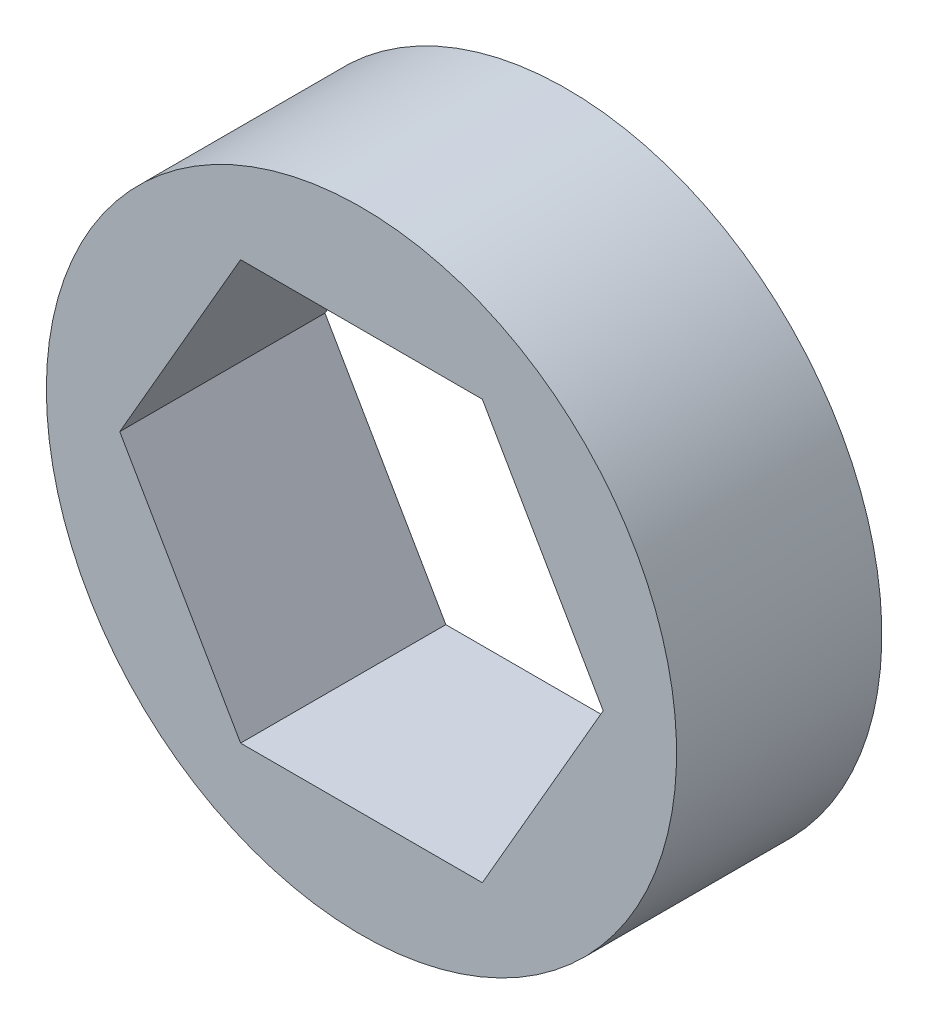
ISO-10303-21;
HEADER;
FILE_DESCRIPTION(('STEP AP214'),'2;1');
FILE_NAME('part.step','',(''),(''),'','','');
FILE_SCHEMA(('AUTOMOTIVE_DESIGN { 1 0 10303 214 1 1 1 1 }'));
ENDSEC;
DATA;
#1=APPLICATION_CONTEXT('core data for automotive mechanical design processes');
#2=APPLICATION_PROTOCOL_DEFINITION('international standard','automotive_design',2000,#1);
#3=PRODUCT_CONTEXT('',#1,'mechanical');
#4=PRODUCT('Part','Part','',(#3));
#5=PRODUCT_RELATED_PRODUCT_CATEGORY('part','',(#4));
#6=PRODUCT_DEFINITION_FORMATION('','',#4);
#7=PRODUCT_DEFINITION_CONTEXT('part definition',#1,'design');
#8=PRODUCT_DEFINITION('design','',#6,#7);
#9=PRODUCT_DEFINITION_SHAPE('','',#8);
#10=(LENGTH_UNIT() NAMED_UNIT(*) SI_UNIT(.MILLI.,.METRE.));
#11=(NAMED_UNIT(*) PLANE_ANGLE_UNIT() SI_UNIT($,.RADIAN.));
#12=(NAMED_UNIT(*) SI_UNIT($,.STERADIAN.) SOLID_ANGLE_UNIT());
#13=UNCERTAINTY_MEASURE_WITH_UNIT(LENGTH_MEASURE(1.E-05),#10,'distance_accuracy_value','');
#14=(GEOMETRIC_REPRESENTATION_CONTEXT(3) GLOBAL_UNCERTAINTY_ASSIGNED_CONTEXT((#13)) GLOBAL_UNIT_ASSIGNED_CONTEXT((#10,
#11,#12)) REPRESENTATION_CONTEXT('',''));
#15=CARTESIAN_POINT('',(0.,0.,0.));
#16=DIRECTION('',(0.,0.,1.));
#17=DIRECTION('',(1.,0.,0.));
#18=AXIS2_PLACEMENT_3D('',#15,#16,#17);
#19=CARTESIAN_POINT('',(-7.47899538708241,0.,3.175));
#20=DIRECTION('',(0.866025403784439,0.5,0.));
#21=DIRECTION('',(-0.5,0.866025403784439,0.));
#22=AXIS2_PLACEMENT_3D('',#19,#20,#21);
#23=PLANE('',#22);
#24=DIRECTION('',(-0.5,0.866025403784438,0.));
#25=VECTOR('',#24,1.);
#26=CARTESIAN_POINT('',(-3.73949769354121,-6.477,3.175));
#27=LINE('',#26,#25);
#28=CARTESIAN_POINT('',(-3.73949769354121,-6.477,3.175));
#29=VERTEX_POINT('',#28);
#30=CARTESIAN_POINT('',(-7.47899538708241,0.,3.175));
#31=VERTEX_POINT('',#30);
#32=EDGE_CURVE('E84',#29,#31,#27,.T.);
#33=ORIENTED_EDGE('',*,*,#32,.F.);
#34=DIRECTION('',(0.,0.,1.));
#35=VECTOR('',#34,1.);
#36=CARTESIAN_POINT('',(-3.73949769354121,-6.477,3.175));
#37=LINE('',#36,#35);
#38=CARTESIAN_POINT('',(-3.73949769354121,-6.477,-3.175));
#39=VERTEX_POINT('',#38);
#40=EDGE_CURVE('E76',#39,#29,#37,.T.);
#41=ORIENTED_EDGE('',*,*,#40,.F.);
#42=DIRECTION('',(-0.5,0.866025403784439,0.));
#43=VECTOR('',#42,1.);
#44=CARTESIAN_POINT('',(-3.73949769354121,-6.477,-3.175));
#45=LINE('',#44,#43);
#46=CARTESIAN_POINT('',(-7.47899538708241,0.,-3.175));
#47=VERTEX_POINT('',#46);
#48=EDGE_CURVE('E116',#39,#47,#45,.T.);
#49=ORIENTED_EDGE('',*,*,#48,.T.);
#50=DIRECTION('',(0.,0.,1.));
#51=VECTOR('',#50,1.);
#52=CARTESIAN_POINT('',(-7.47899538708241,0.,3.175));
#53=LINE('',#52,#51);
#54=EDGE_CURVE('E101',#31,#47,#53,.F.);
#55=ORIENTED_EDGE('',*,*,#54,.F.);
#56=EDGE_LOOP('',(#33,#41,#49,#55));
#57=FACE_BOUND('',#56,.T.);
#58=ADVANCED_FACE('F17',(#57),#23,.T.);
#59=CARTESIAN_POINT('',(-3.73949769354121,6.477,3.175));
#60=DIRECTION('',(0.866025403784439,-0.5,0.));
#61=DIRECTION('',(0.5,0.866025403784439,0.));
#62=AXIS2_PLACEMENT_3D('',#59,#60,#61);
#63=PLANE('',#62);
#64=DIRECTION('',(0.5,0.866025403784439,0.));
#65=VECTOR('',#64,1.);
#66=CARTESIAN_POINT('',(-7.47899538708242,0.,3.175));
#67=LINE('',#66,#65);
#68=CARTESIAN_POINT('',(-3.73949769354121,6.477,3.175));
#69=VERTEX_POINT('',#68);
#70=EDGE_CURVE('E109',#31,#69,#67,.T.);
#71=ORIENTED_EDGE('',*,*,#70,.F.);
#72=ORIENTED_EDGE('',*,*,#54,.T.);
#73=DIRECTION('',(0.5,0.866025403784439,0.));
#74=VECTOR('',#73,1.);
#75=CARTESIAN_POINT('',(-7.47899538708241,0.,-3.175));
#76=LINE('',#75,#74);
#77=CARTESIAN_POINT('',(-3.73949769354121,6.477,-3.175));
#78=VERTEX_POINT('',#77);
#79=EDGE_CURVE('E107',#47,#78,#76,.T.);
#80=ORIENTED_EDGE('',*,*,#79,.T.);
#81=DIRECTION('',(0.,0.,1.));
#82=VECTOR('',#81,1.);
#83=CARTESIAN_POINT('',(-3.73949769354121,6.477,3.175));
#84=LINE('',#83,#82);
#85=EDGE_CURVE('E98',#69,#78,#84,.F.);
#86=ORIENTED_EDGE('',*,*,#85,.F.);
#87=EDGE_LOOP('',(#71,#72,#80,#86));
#88=FACE_BOUND('',#87,.T.);
#89=ADVANCED_FACE('F106',(#88),#63,.T.);
#90=CARTESIAN_POINT('',(3.7394976935412,6.477,3.175));
#91=DIRECTION('',(0.,-1.,0.));
#92=DIRECTION('',(1.,0.,0.));
#93=AXIS2_PLACEMENT_3D('',#90,#91,#92);
#94=PLANE('',#93);
#95=DIRECTION('',(1.,0.,0.));
#96=VECTOR('',#95,1.);
#97=CARTESIAN_POINT('',(0.,6.477,3.175));
#98=LINE('',#97,#96);
#99=CARTESIAN_POINT('',(3.7394976935412,6.477,3.175));
#100=VERTEX_POINT('',#99);
#101=EDGE_CURVE('E126',#69,#100,#98,.T.);
#102=ORIENTED_EDGE('',*,*,#101,.F.);
#103=ORIENTED_EDGE('',*,*,#85,.T.);
#104=DIRECTION('',(1.,0.,0.));
#105=VECTOR('',#104,1.);
#106=CARTESIAN_POINT('',(0.,6.477,-3.175));
#107=LINE('',#106,#105);
#108=CARTESIAN_POINT('',(3.7394976935412,6.477,-3.175));
#109=VERTEX_POINT('',#108);
#110=EDGE_CURVE('E118',#78,#109,#107,.T.);
#111=ORIENTED_EDGE('',*,*,#110,.T.);
#112=DIRECTION('',(0.,0.,1.));
#113=VECTOR('',#112,1.);
#114=CARTESIAN_POINT('',(3.7394976935412,6.47700000000001,3.175));
#115=LINE('',#114,#113);
#116=EDGE_CURVE('E95',#100,#109,#115,.F.);
#117=ORIENTED_EDGE('',*,*,#116,.F.);
#118=EDGE_LOOP('',(#102,#103,#111,#117));
#119=FACE_BOUND('',#118,.T.);
#120=ADVANCED_FACE('F135',(#119),#94,.T.);
#121=CARTESIAN_POINT('',(7.47899538708241,0.,3.175));
#122=DIRECTION('',(-0.866025403784439,-0.5,0.));
#123=DIRECTION('',(0.5,-0.866025403784439,0.));
#124=AXIS2_PLACEMENT_3D('',#121,#122,#123);
#125=PLANE('',#124);
#126=DIRECTION('',(0.5,-0.866025403784438,0.));
#127=VECTOR('',#126,1.);
#128=CARTESIAN_POINT('',(3.7394976935412,6.477,3.175));
#129=LINE('',#128,#127);
#130=CARTESIAN_POINT('',(7.47899538708242,0.,3.175));
#131=VERTEX_POINT('',#130);
#132=EDGE_CURVE('E89',#100,#131,#129,.T.);
#133=ORIENTED_EDGE('',*,*,#132,.F.);
#134=ORIENTED_EDGE('',*,*,#116,.T.);
#135=DIRECTION('',(0.5,-0.866025403784438,0.));
#136=VECTOR('',#135,1.);
#137=CARTESIAN_POINT('',(3.7394976935412,6.477,-3.175));
#138=LINE('',#137,#136);
#139=CARTESIAN_POINT('',(7.47899538708241,0.,-3.175));
#140=VERTEX_POINT('',#139);
#141=EDGE_CURVE('E120',#109,#140,#138,.T.);
#142=ORIENTED_EDGE('',*,*,#141,.T.);
#143=DIRECTION('',(0.,0.,1.));
#144=VECTOR('',#143,1.);
#145=CARTESIAN_POINT('',(7.47899538708242,0.,3.175));
#146=LINE('',#145,#144);
#147=EDGE_CURVE('E65',#131,#140,#146,.F.);
#148=ORIENTED_EDGE('',*,*,#147,.F.);
#149=EDGE_LOOP('',(#133,#134,#142,#148));
#150=FACE_BOUND('',#149,.T.);
#151=ADVANCED_FACE('F132',(#150),#125,.T.);
#152=CARTESIAN_POINT('',(3.73949769354121,-6.477,3.175));
#153=DIRECTION('',(-0.866025403784439,0.5,0.));
#154=DIRECTION('',(-0.5,-0.866025403784439,0.));
#155=AXIS2_PLACEMENT_3D('',#152,#153,#154);
#156=PLANE('',#155);
#157=DIRECTION('',(-0.5,-0.866025403784439,0.));
#158=VECTOR('',#157,1.);
#159=CARTESIAN_POINT('',(7.47899538708241,0.,3.175));
#160=LINE('',#159,#158);
#161=CARTESIAN_POINT('',(3.73949769354121,-6.477,3.175));
#162=VERTEX_POINT('',#161);
#163=EDGE_CURVE('E71',#131,#162,#160,.T.);
#164=ORIENTED_EDGE('',*,*,#163,.F.);
#165=ORIENTED_EDGE('',*,*,#147,.T.);
#166=DIRECTION('',(-0.5,-0.866025403784439,0.));
#167=VECTOR('',#166,1.);
#168=CARTESIAN_POINT('',(7.47899538708241,0.,-3.175));
#169=LINE('',#168,#167);
#170=CARTESIAN_POINT('',(3.73949769354121,-6.477,-3.175));
#171=VERTEX_POINT('',#170);
#172=EDGE_CURVE('E33',#140,#171,#169,.T.);
#173=ORIENTED_EDGE('',*,*,#172,.T.);
#174=DIRECTION('',(0.,0.,1.));
#175=VECTOR('',#174,1.);
#176=CARTESIAN_POINT('',(3.73949769354121,-6.477,3.175));
#177=LINE('',#176,#175);
#178=EDGE_CURVE('E67',#162,#171,#177,.F.);
#179=ORIENTED_EDGE('',*,*,#178,.F.);
#180=EDGE_LOOP('',(#164,#165,#173,#179));
#181=FACE_BOUND('',#180,.T.);
#182=ADVANCED_FACE('F69',(#181),#156,.T.);
#183=CARTESIAN_POINT('',(-3.73949769354121,-6.477,3.175));
#184=DIRECTION('',(0.,1.,0.));
#185=DIRECTION('',(0.,0.,1.));
#186=AXIS2_PLACEMENT_3D('',#183,#184,#185);
#187=PLANE('',#186);
#188=DIRECTION('',(1.,0.,0.));
#189=VECTOR('',#188,1.);
#190=CARTESIAN_POINT('',(0.,-6.477,3.175));
#191=LINE('',#190,#189);
#192=EDGE_CURVE('E79',#162,#29,#191,.F.);
#193=ORIENTED_EDGE('',*,*,#192,.F.);
#194=ORIENTED_EDGE('',*,*,#178,.T.);
#195=DIRECTION('',(1.,0.,0.));
#196=VECTOR('',#195,1.);
#197=CARTESIAN_POINT('',(0.,-6.477,-3.175));
#198=LINE('',#197,#196);
#199=EDGE_CURVE('E128',#171,#39,#198,.F.);
#200=ORIENTED_EDGE('',*,*,#199,.T.);
#201=ORIENTED_EDGE('',*,*,#40,.T.);
#202=EDGE_LOOP('',(#193,#194,#200,#201));
#203=FACE_BOUND('',#202,.T.);
#204=ADVANCED_FACE('F80',(#203),#187,.T.);
#205=CARTESIAN_POINT('',(0.,0.,3.175));
#206=DIRECTION('',(0.,0.,1.));
#207=DIRECTION('',(1.,0.,0.));
#208=AXIS2_PLACEMENT_3D('',#205,#206,#207);
#209=PLANE('',#208);
#210=ORIENTED_EDGE('',*,*,#101,.T.);
#211=ORIENTED_EDGE('',*,*,#132,.T.);
#212=ORIENTED_EDGE('',*,*,#163,.T.);
#213=ORIENTED_EDGE('',*,*,#192,.T.);
#214=ORIENTED_EDGE('',*,*,#32,.T.);
#215=ORIENTED_EDGE('',*,*,#70,.T.);
#216=EDGE_LOOP('',(#210,#211,#212,#213,#214,#215));
#217=FACE_BOUND('',#216,.T.);
#218=CARTESIAN_POINT('',(0.,0.,3.175));
#219=DIRECTION('',(0.,0.,-1.));
#220=DIRECTION('',(-1.,0.,0.));
#221=AXIS2_PLACEMENT_3D('',#218,#219,#220);
#222=CIRCLE('',#221,9.75);
#223=CARTESIAN_POINT('',(-9.75,0.,3.175));
#224=VERTEX_POINT('',#223);
#225=EDGE_CURVE('E20',#224,#224,#222,.T.);
#226=ORIENTED_EDGE('',*,*,#225,.F.);
#227=EDGE_LOOP('',(#226));
#228=FACE_BOUND('',#227,.T.);
#229=ADVANCED_FACE('F87',(#217,#228),#209,.T.);
#230=CARTESIAN_POINT('',(0.,0.,-3.175));
#231=DIRECTION('',(0.,0.,1.));
#232=DIRECTION('',(1.,0.,0.));
#233=AXIS2_PLACEMENT_3D('',#230,#231,#232);
#234=PLANE('',#233);
#235=ORIENTED_EDGE('',*,*,#172,.F.);
#236=ORIENTED_EDGE('',*,*,#141,.F.);
#237=ORIENTED_EDGE('',*,*,#110,.F.);
#238=ORIENTED_EDGE('',*,*,#79,.F.);
#239=ORIENTED_EDGE('',*,*,#48,.F.);
#240=ORIENTED_EDGE('',*,*,#199,.F.);
#241=EDGE_LOOP('',(#235,#236,#237,#238,#239,#240));
#242=FACE_BOUND('',#241,.T.);
#243=CARTESIAN_POINT('',(0.,0.,-3.175));
#244=DIRECTION('',(0.,0.,-1.));
#245=DIRECTION('',(-1.,0.,0.));
#246=AXIS2_PLACEMENT_3D('',#243,#244,#245);
#247=CIRCLE('',#246,9.75);
#248=CARTESIAN_POINT('',(-9.75,0.,-3.175));
#249=VERTEX_POINT('',#248);
#250=EDGE_CURVE('E10',#249,#249,#247,.F.);
#251=ORIENTED_EDGE('',*,*,#250,.F.);
#252=EDGE_LOOP('',(#251));
#253=FACE_BOUND('',#252,.T.);
#254=ADVANCED_FACE('F114',(#242,#253),#234,.F.);
#255=CARTESIAN_POINT('',(0.,0.,3.175));
#256=DIRECTION('',(0.,0.,-1.));
#257=DIRECTION('',(-1.,0.,0.));
#258=AXIS2_PLACEMENT_3D('',#255,#256,#257);
#259=CYLINDRICAL_SURFACE('',#258,9.75);
#260=ORIENTED_EDGE('',*,*,#250,.T.);
#261=EDGE_LOOP('',(#260));
#262=FACE_BOUND('',#261,.T.);
#263=ORIENTED_EDGE('',*,*,#225,.T.);
#264=EDGE_LOOP('',(#263));
#265=FACE_BOUND('',#264,.T.);
#266=ADVANCED_FACE('F144',(#262,#265),#259,.T.);
#267=CLOSED_SHELL('',(#58,#89,#120,#151,#182,#204,#229,#254,#266));
#268=MANIFOLD_SOLID_BREP('B1',#267);
#269=ADVANCED_BREP_SHAPE_REPRESENTATION('',(#18,#268),#14);
#270=SHAPE_DEFINITION_REPRESENTATION(#9,#269);
ENDSEC;
END-ISO-10303-21;
